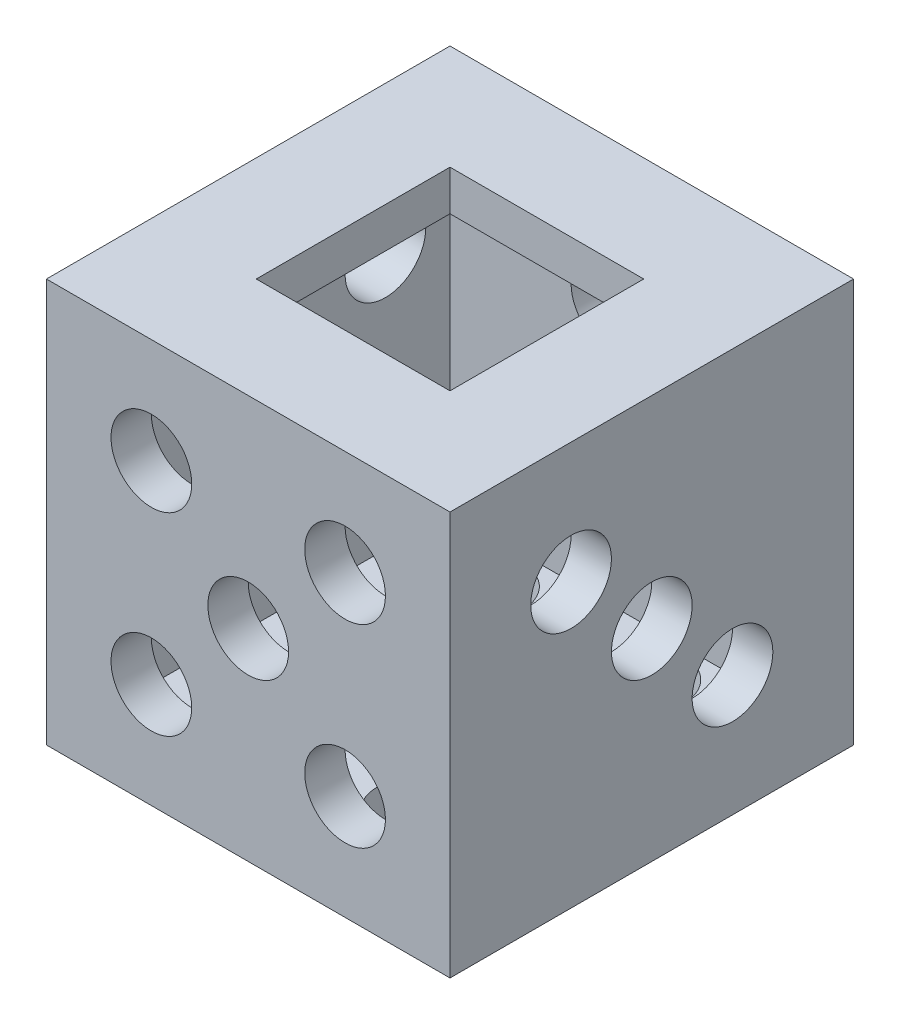
ISO-10303-21;
HEADER;
FILE_DESCRIPTION(('STEP AP214'),'2;1');
FILE_NAME('part.step','',(''),(''),'','','');
FILE_SCHEMA(('AUTOMOTIVE_DESIGN { 1 0 10303 214 1 1 1 1 }'));
ENDSEC;
DATA;
#1=APPLICATION_CONTEXT('core data for automotive mechanical design processes');
#2=APPLICATION_PROTOCOL_DEFINITION('international standard','automotive_design',2000,#1);
#3=PRODUCT_CONTEXT('',#1,'mechanical');
#4=PRODUCT('Part','Part','',(#3));
#5=PRODUCT_RELATED_PRODUCT_CATEGORY('part','',(#4));
#6=PRODUCT_DEFINITION_FORMATION('','',#4);
#7=PRODUCT_DEFINITION_CONTEXT('part definition',#1,'design');
#8=PRODUCT_DEFINITION('design','',#6,#7);
#9=PRODUCT_DEFINITION_SHAPE('','',#8);
#10=(LENGTH_UNIT() NAMED_UNIT(*) SI_UNIT(.MILLI.,.METRE.));
#11=(NAMED_UNIT(*) PLANE_ANGLE_UNIT() SI_UNIT($,.RADIAN.));
#12=(NAMED_UNIT(*) SI_UNIT($,.STERADIAN.) SOLID_ANGLE_UNIT());
#13=UNCERTAINTY_MEASURE_WITH_UNIT(LENGTH_MEASURE(1.E-05),#10,'distance_accuracy_value','');
#14=(GEOMETRIC_REPRESENTATION_CONTEXT(3) GLOBAL_UNCERTAINTY_ASSIGNED_CONTEXT((#13)) GLOBAL_UNIT_ASSIGNED_CONTEXT((#10,
#11,#12)) REPRESENTATION_CONTEXT('',''));
#15=CARTESIAN_POINT('',(0.,0.,0.));
#16=DIRECTION('',(0.,0.,1.));
#17=DIRECTION('',(1.,0.,0.));
#18=AXIS2_PLACEMENT_3D('',#15,#16,#17);
#19=CARTESIAN_POINT('',(10.,25.,-12.5));
#20=DIRECTION('',(-1.,0.,0.));
#21=DIRECTION('',(0.,0.,1.));
#22=AXIS2_PLACEMENT_3D('',#19,#20,#21);
#23=PLANE('',#22);
#24=CARTESIAN_POINT('',(10.,7.50000000000005,-5.));
#25=DIRECTION('',(-1.,0.,0.));
#26=DIRECTION('',(0.,0.,1.));
#27=AXIS2_PLACEMENT_3D('',#24,#25,#26);
#28=CIRCLE('',#27,2.5);
#29=CARTESIAN_POINT('',(10.,7.50000000000005,-2.5));
#30=VERTEX_POINT('',#29);
#31=EDGE_CURVE('E706',#30,#30,#28,.T.);
#32=ORIENTED_EDGE('',*,*,#31,.F.);
#33=EDGE_LOOP('',(#32));
#34=FACE_BOUND('',#33,.T.);
#35=CARTESIAN_POINT('',(10.,12.5,0.));
#36=DIRECTION('',(-1.,0.,0.));
#37=DIRECTION('',(0.,0.,1.));
#38=AXIS2_PLACEMENT_3D('',#35,#36,#37);
#39=CIRCLE('',#38,2.5);
#40=CARTESIAN_POINT('',(10.,12.5,2.5));
#41=VERTEX_POINT('',#40);
#42=EDGE_CURVE('E702',#41,#41,#39,.T.);
#43=ORIENTED_EDGE('',*,*,#42,.F.);
#44=EDGE_LOOP('',(#43));
#45=FACE_BOUND('',#44,.T.);
#46=CARTESIAN_POINT('',(10.,17.5,5.));
#47=DIRECTION('',(-1.,0.,0.));
#48=DIRECTION('',(0.,0.,1.));
#49=AXIS2_PLACEMENT_3D('',#46,#47,#48);
#50=CIRCLE('',#49,2.5);
#51=CARTESIAN_POINT('',(10.,17.5,7.5));
#52=VERTEX_POINT('',#51);
#53=EDGE_CURVE('E714',#52,#52,#50,.T.);
#54=ORIENTED_EDGE('',*,*,#53,.F.);
#55=EDGE_LOOP('',(#54));
#56=FACE_BOUND('',#55,.T.);
#57=DIRECTION('',(0.,0.,-1.));
#58=VECTOR('',#57,1.);
#59=CARTESIAN_POINT('',(10.,2.5,-12.5));
#60=LINE('',#59,#58);
#61=CARTESIAN_POINT('',(10.,2.5,10.));
#62=VERTEX_POINT('',#61);
#63=CARTESIAN_POINT('',(10.,2.5,-10.));
#64=VERTEX_POINT('',#63);
#65=EDGE_CURVE('E206',#62,#64,#60,.T.);
#66=ORIENTED_EDGE('',*,*,#65,.F.);
#67=DIRECTION('',(0.,-1.,0.));
#68=VECTOR('',#67,1.);
#69=CARTESIAN_POINT('',(10.,25.,10.));
#70=LINE('',#69,#68);
#71=CARTESIAN_POINT('',(10.,22.5,10.));
#72=VERTEX_POINT('',#71);
#73=EDGE_CURVE('E242',#72,#62,#70,.T.);
#74=ORIENTED_EDGE('',*,*,#73,.F.);
#75=DIRECTION('',(0.,0.,-1.));
#76=VECTOR('',#75,1.);
#77=CARTESIAN_POINT('',(10.,22.5,-12.5));
#78=LINE('',#77,#76);
#79=CARTESIAN_POINT('',(10.,22.5,-10.));
#80=VERTEX_POINT('',#79);
#81=EDGE_CURVE('E217',#72,#80,#78,.T.);
#82=ORIENTED_EDGE('',*,*,#81,.T.);
#83=DIRECTION('',(0.,-1.,0.));
#84=VECTOR('',#83,1.);
#85=CARTESIAN_POINT('',(10.,25.,-10.));
#86=LINE('',#85,#84);
#87=EDGE_CURVE('E235',#80,#64,#86,.T.);
#88=ORIENTED_EDGE('',*,*,#87,.T.);
#89=EDGE_LOOP('',(#66,#74,#82,#88));
#90=FACE_BOUND('',#89,.T.);
#91=ADVANCED_FACE('F39',(#34,#45,#56,#90),#23,.T.);
#92=CARTESIAN_POINT('',(-12.5,25.,-10.));
#93=DIRECTION('',(0.,0.,1.));
#94=DIRECTION('',(1.,0.,0.));
#95=AXIS2_PLACEMENT_3D('',#92,#93,#94);
#96=PLANE('',#95);
#97=CARTESIAN_POINT('',(0.,18.5,-10.));
#98=DIRECTION('',(0.,0.,1.));
#99=DIRECTION('',(1.,0.,0.));
#100=AXIS2_PLACEMENT_3D('',#97,#98,#99);
#101=CIRCLE('',#100,2.5);
#102=CARTESIAN_POINT('',(2.5,18.5,-10.));
#103=VERTEX_POINT('',#102);
#104=EDGE_CURVE('E605',#103,#103,#101,.T.);
#105=ORIENTED_EDGE('',*,*,#104,.F.);
#106=EDGE_LOOP('',(#105));
#107=FACE_BOUND('',#106,.T.);
#108=CARTESIAN_POINT('',(0.,6.5,-10.));
#109=DIRECTION('',(0.,0.,1.));
#110=DIRECTION('',(1.,0.,0.));
#111=AXIS2_PLACEMENT_3D('',#108,#109,#110);
#112=CIRCLE('',#111,2.5);
#113=CARTESIAN_POINT('',(2.5,6.5,-10.));
#114=VERTEX_POINT('',#113);
#115=EDGE_CURVE('E610',#114,#114,#112,.T.);
#116=ORIENTED_EDGE('',*,*,#115,.F.);
#117=EDGE_LOOP('',(#116));
#118=FACE_BOUND('',#117,.T.);
#119=DIRECTION('',(-1.,0.,0.));
#120=VECTOR('',#119,1.);
#121=CARTESIAN_POINT('',(-12.5,2.5,-10.));
#122=LINE('',#121,#120);
#123=CARTESIAN_POINT('',(-10.,2.5,-10.));
#124=VERTEX_POINT('',#123);
#125=EDGE_CURVE('E239',#64,#124,#122,.T.);
#126=ORIENTED_EDGE('',*,*,#125,.F.);
#127=ORIENTED_EDGE('',*,*,#87,.F.);
#128=DIRECTION('',(-1.,0.,0.));
#129=VECTOR('',#128,1.);
#130=CARTESIAN_POINT('',(-12.5,22.5,-10.));
#131=LINE('',#130,#129);
#132=CARTESIAN_POINT('',(-10.,22.5,-10.));
#133=VERTEX_POINT('',#132);
#134=EDGE_CURVE('E214',#80,#133,#131,.T.);
#135=ORIENTED_EDGE('',*,*,#134,.T.);
#136=DIRECTION('',(0.,-1.,0.));
#137=VECTOR('',#136,1.);
#138=CARTESIAN_POINT('',(-10.,25.,-10.));
#139=LINE('',#138,#137);
#140=EDGE_CURVE('E228',#133,#124,#139,.T.);
#141=ORIENTED_EDGE('',*,*,#140,.T.);
#142=EDGE_LOOP('',(#126,#127,#135,#141));
#143=FACE_BOUND('',#142,.T.);
#144=ADVANCED_FACE('F272',(#107,#118,#143),#96,.T.);
#145=CARTESIAN_POINT('',(-10.,25.,-12.5));
#146=DIRECTION('',(1.,0.,0.));
#147=DIRECTION('',(0.,0.,-1.));
#148=AXIS2_PLACEMENT_3D('',#145,#146,#147);
#149=PLANE('',#148);
#150=CARTESIAN_POINT('',(-10.,6.5,-6.));
#151=DIRECTION('',(1.,0.,0.));
#152=DIRECTION('',(0.,0.,-1.));
#153=AXIS2_PLACEMENT_3D('',#150,#151,#152);
#154=CIRCLE('',#153,2.5);
#155=CARTESIAN_POINT('',(-10.,6.5,-8.5));
#156=VERTEX_POINT('',#155);
#157=EDGE_CURVE('E674',#156,#156,#154,.T.);
#158=ORIENTED_EDGE('',*,*,#157,.F.);
#159=EDGE_LOOP('',(#158));
#160=FACE_BOUND('',#159,.T.);
#161=CARTESIAN_POINT('',(-10.,6.5,6.));
#162=DIRECTION('',(1.,0.,0.));
#163=DIRECTION('',(0.,0.,-1.));
#164=AXIS2_PLACEMENT_3D('',#161,#162,#163);
#165=CIRCLE('',#164,2.5);
#166=CARTESIAN_POINT('',(-10.,6.5,3.5));
#167=VERTEX_POINT('',#166);
#168=EDGE_CURVE('E667',#167,#167,#165,.T.);
#169=ORIENTED_EDGE('',*,*,#168,.F.);
#170=EDGE_LOOP('',(#169));
#171=FACE_BOUND('',#170,.T.);
#172=CARTESIAN_POINT('',(-10.,18.5,6.));
#173=DIRECTION('',(1.,0.,0.));
#174=DIRECTION('',(0.,0.,-1.));
#175=AXIS2_PLACEMENT_3D('',#172,#173,#174);
#176=CIRCLE('',#175,2.5);
#177=CARTESIAN_POINT('',(-10.,18.5,3.5));
#178=VERTEX_POINT('',#177);
#179=EDGE_CURVE('E682',#178,#178,#176,.T.);
#180=ORIENTED_EDGE('',*,*,#179,.F.);
#181=EDGE_LOOP('',(#180));
#182=FACE_BOUND('',#181,.T.);
#183=CARTESIAN_POINT('',(-10.,18.5,-6.));
#184=DIRECTION('',(1.,0.,0.));
#185=DIRECTION('',(0.,0.,-1.));
#186=AXIS2_PLACEMENT_3D('',#183,#184,#185);
#187=CIRCLE('',#186,2.5);
#188=CARTESIAN_POINT('',(-10.,18.5,-8.5));
#189=VERTEX_POINT('',#188);
#190=EDGE_CURVE('E690',#189,#189,#187,.T.);
#191=ORIENTED_EDGE('',*,*,#190,.F.);
#192=EDGE_LOOP('',(#191));
#193=FACE_BOUND('',#192,.T.);
#194=DIRECTION('',(0.,0.,1.));
#195=VECTOR('',#194,1.);
#196=CARTESIAN_POINT('',(-10.,2.5,-12.5));
#197=LINE('',#196,#195);
#198=CARTESIAN_POINT('',(-10.,2.5,10.));
#199=VERTEX_POINT('',#198);
#200=EDGE_CURVE('E232',#124,#199,#197,.T.);
#201=ORIENTED_EDGE('',*,*,#200,.F.);
#202=ORIENTED_EDGE('',*,*,#140,.F.);
#203=DIRECTION('',(0.,0.,1.));
#204=VECTOR('',#203,1.);
#205=CARTESIAN_POINT('',(-10.,22.5,-12.5));
#206=LINE('',#205,#204);
#207=CARTESIAN_POINT('',(-10.,22.5,10.));
#208=VERTEX_POINT('',#207);
#209=EDGE_CURVE('E211',#133,#208,#206,.T.);
#210=ORIENTED_EDGE('',*,*,#209,.T.);
#211=DIRECTION('',(0.,-1.,0.));
#212=VECTOR('',#211,1.);
#213=CARTESIAN_POINT('',(-10.,25.,10.));
#214=LINE('',#213,#212);
#215=EDGE_CURVE('E221',#208,#199,#214,.T.);
#216=ORIENTED_EDGE('',*,*,#215,.T.);
#217=EDGE_LOOP('',(#201,#202,#210,#216));
#218=FACE_BOUND('',#217,.T.);
#219=ADVANCED_FACE('F278',(#160,#171,#182,#193,#218),#149,.T.);
#220=CARTESIAN_POINT('',(-12.5,25.,10.));
#221=DIRECTION('',(0.,0.,-1.));
#222=DIRECTION('',(-1.,0.,0.));
#223=AXIS2_PLACEMENT_3D('',#220,#221,#222);
#224=PLANE('',#223);
#225=CARTESIAN_POINT('',(6.,6.5,10.));
#226=DIRECTION('',(0.,0.,-1.));
#227=DIRECTION('',(-1.,0.,0.));
#228=AXIS2_PLACEMENT_3D('',#225,#226,#227);
#229=CIRCLE('',#228,2.5);
#230=CARTESIAN_POINT('',(3.5,6.5,10.));
#231=VERTEX_POINT('',#230);
#232=EDGE_CURVE('E658',#231,#231,#229,.T.);
#233=ORIENTED_EDGE('',*,*,#232,.F.);
#234=EDGE_LOOP('',(#233));
#235=FACE_BOUND('',#234,.T.);
#236=CARTESIAN_POINT('',(-6.,6.5,10.));
#237=DIRECTION('',(0.,0.,-1.));
#238=DIRECTION('',(-1.,0.,0.));
#239=AXIS2_PLACEMENT_3D('',#236,#237,#238);
#240=CIRCLE('',#239,2.5);
#241=CARTESIAN_POINT('',(-8.5,6.5,10.));
#242=VERTEX_POINT('',#241);
#243=EDGE_CURVE('E654',#242,#242,#240,.T.);
#244=ORIENTED_EDGE('',*,*,#243,.F.);
#245=EDGE_LOOP('',(#244));
#246=FACE_BOUND('',#245,.T.);
#247=CARTESIAN_POINT('',(-6.,18.5,10.));
#248=DIRECTION('',(0.,0.,-1.));
#249=DIRECTION('',(-1.,0.,0.));
#250=AXIS2_PLACEMENT_3D('',#247,#248,#249);
#251=CIRCLE('',#250,2.5);
#252=CARTESIAN_POINT('',(-8.5,18.5,10.));
#253=VERTEX_POINT('',#252);
#254=EDGE_CURVE('E650',#253,#253,#251,.T.);
#255=ORIENTED_EDGE('',*,*,#254,.F.);
#256=EDGE_LOOP('',(#255));
#257=FACE_BOUND('',#256,.T.);
#258=CARTESIAN_POINT('',(6.,18.5,10.));
#259=DIRECTION('',(0.,0.,-1.));
#260=DIRECTION('',(-1.,0.,0.));
#261=AXIS2_PLACEMENT_3D('',#258,#259,#260);
#262=CIRCLE('',#261,2.5);
#263=CARTESIAN_POINT('',(3.5,18.5,10.));
#264=VERTEX_POINT('',#263);
#265=EDGE_CURVE('E646',#264,#264,#262,.T.);
#266=ORIENTED_EDGE('',*,*,#265,.F.);
#267=EDGE_LOOP('',(#266));
#268=FACE_BOUND('',#267,.T.);
#269=CARTESIAN_POINT('',(0.,12.5,10.));
#270=DIRECTION('',(0.,0.,-1.));
#271=DIRECTION('',(-1.,0.,0.));
#272=AXIS2_PLACEMENT_3D('',#269,#270,#271);
#273=CIRCLE('',#272,2.5);
#274=CARTESIAN_POINT('',(-2.5,12.5,10.));
#275=VERTEX_POINT('',#274);
#276=EDGE_CURVE('E642',#275,#275,#273,.T.);
#277=ORIENTED_EDGE('',*,*,#276,.F.);
#278=EDGE_LOOP('',(#277));
#279=FACE_BOUND('',#278,.T.);
#280=DIRECTION('',(1.,0.,0.));
#281=VECTOR('',#280,1.);
#282=CARTESIAN_POINT('',(-12.5,2.5,10.));
#283=LINE('',#282,#281);
#284=EDGE_CURVE('E225',#199,#62,#283,.T.);
#285=ORIENTED_EDGE('',*,*,#284,.F.);
#286=ORIENTED_EDGE('',*,*,#215,.F.);
#287=DIRECTION('',(1.,0.,0.));
#288=VECTOR('',#287,1.);
#289=CARTESIAN_POINT('',(-12.5,22.5,10.));
#290=LINE('',#289,#288);
#291=EDGE_CURVE('E207',#208,#72,#290,.T.);
#292=ORIENTED_EDGE('',*,*,#291,.T.);
#293=ORIENTED_EDGE('',*,*,#73,.T.);
#294=EDGE_LOOP('',(#285,#286,#292,#293));
#295=FACE_BOUND('',#294,.T.);
#296=ADVANCED_FACE('F289',(#235,#246,#257,#268,#279,#295),#224,.T.);
#297=CARTESIAN_POINT('',(0.,22.5,0.));
#298=DIRECTION('',(0.,1.,0.));
#299=DIRECTION('',(0.,0.,1.));
#300=AXIS2_PLACEMENT_3D('',#297,#298,#299);
#301=PLANE('',#300);
#302=DIRECTION('',(1.,0.,0.));
#303=VECTOR('',#302,1.);
#304=CARTESIAN_POINT('',(0.,22.5,6.));
#305=LINE('',#304,#303);
#306=CARTESIAN_POINT('',(-6.,22.5,6.));
#307=VERTEX_POINT('',#306);
#308=CARTESIAN_POINT('',(6.,22.5,6.));
#309=VERTEX_POINT('',#308);
#310=EDGE_CURVE('E48',#307,#309,#305,.T.);
#311=ORIENTED_EDGE('',*,*,#310,.T.);
#312=DIRECTION('',(0.,0.,-1.));
#313=VECTOR('',#312,1.);
#314=CARTESIAN_POINT('',(6.,22.5,0.));
#315=LINE('',#314,#313);
#316=CARTESIAN_POINT('',(6.,22.5,-6.));
#317=VERTEX_POINT('',#316);
#318=EDGE_CURVE('E11',#309,#317,#315,.T.);
#319=ORIENTED_EDGE('',*,*,#318,.T.);
#320=DIRECTION('',(-1.,0.,0.));
#321=VECTOR('',#320,1.);
#322=CARTESIAN_POINT('',(0.,22.5,-6.));
#323=LINE('',#322,#321);
#324=CARTESIAN_POINT('',(-6.,22.5,-6.));
#325=VERTEX_POINT('',#324);
#326=EDGE_CURVE('E210',#317,#325,#323,.T.);
#327=ORIENTED_EDGE('',*,*,#326,.T.);
#328=DIRECTION('',(0.,0.,1.));
#329=VECTOR('',#328,1.);
#330=CARTESIAN_POINT('',(-6.,22.5,0.));
#331=LINE('',#330,#329);
#332=EDGE_CURVE('E135',#325,#307,#331,.T.);
#333=ORIENTED_EDGE('',*,*,#332,.T.);
#334=EDGE_LOOP('',(#311,#319,#327,#333));
#335=FACE_BOUND('',#334,.T.);
#336=ORIENTED_EDGE('',*,*,#81,.F.);
#337=ORIENTED_EDGE('',*,*,#291,.F.);
#338=ORIENTED_EDGE('',*,*,#209,.F.);
#339=ORIENTED_EDGE('',*,*,#134,.F.);
#340=EDGE_LOOP('',(#336,#337,#338,#339));
#341=FACE_BOUND('',#340,.T.);
#342=ADVANCED_FACE('F255',(#335,#341),#301,.F.);
#343=CARTESIAN_POINT('',(0.,2.5,0.));
#344=DIRECTION('',(0.,1.,0.));
#345=DIRECTION('',(0.,0.,1.));
#346=AXIS2_PLACEMENT_3D('',#343,#344,#345);
#347=PLANE('',#346);
#348=CARTESIAN_POINT('',(-5.,2.5,0.));
#349=DIRECTION('',(0.,1.,0.));
#350=DIRECTION('',(0.,0.,1.));
#351=AXIS2_PLACEMENT_3D('',#348,#349,#350);
#352=CIRCLE('',#351,2.5);
#353=CARTESIAN_POINT('',(-5.,2.5,2.5));
#354=VERTEX_POINT('',#353);
#355=EDGE_CURVE('E762',#354,#354,#352,.T.);
#356=ORIENTED_EDGE('',*,*,#355,.F.);
#357=EDGE_LOOP('',(#356));
#358=FACE_BOUND('',#357,.T.);
#359=CARTESIAN_POINT('',(-5.,2.5,-7.));
#360=DIRECTION('',(0.,1.,0.));
#361=DIRECTION('',(0.,0.,1.));
#362=AXIS2_PLACEMENT_3D('',#359,#360,#361);
#363=CIRCLE('',#362,2.5);
#364=CARTESIAN_POINT('',(-5.,2.5,-4.5));
#365=VERTEX_POINT('',#364);
#366=EDGE_CURVE('E758',#365,#365,#363,.T.);
#367=ORIENTED_EDGE('',*,*,#366,.F.);
#368=EDGE_LOOP('',(#367));
#369=FACE_BOUND('',#368,.T.);
#370=CARTESIAN_POINT('',(5.,2.5,7.));
#371=DIRECTION('',(0.,1.,0.));
#372=DIRECTION('',(0.,0.,1.));
#373=AXIS2_PLACEMENT_3D('',#370,#371,#372);
#374=CIRCLE('',#373,2.5);
#375=CARTESIAN_POINT('',(5.,2.5,9.5));
#376=VERTEX_POINT('',#375);
#377=EDGE_CURVE('E754',#376,#376,#374,.T.);
#378=ORIENTED_EDGE('',*,*,#377,.F.);
#379=EDGE_LOOP('',(#378));
#380=FACE_BOUND('',#379,.T.);
#381=CARTESIAN_POINT('',(5.,2.5,0.));
#382=DIRECTION('',(0.,1.,0.));
#383=DIRECTION('',(0.,0.,1.));
#384=AXIS2_PLACEMENT_3D('',#381,#382,#383);
#385=CIRCLE('',#384,2.5);
#386=CARTESIAN_POINT('',(5.,2.5,2.5));
#387=VERTEX_POINT('',#386);
#388=EDGE_CURVE('E750',#387,#387,#385,.T.);
#389=ORIENTED_EDGE('',*,*,#388,.F.);
#390=EDGE_LOOP('',(#389));
#391=FACE_BOUND('',#390,.T.);
#392=CARTESIAN_POINT('',(5.,2.5,-7.));
#393=DIRECTION('',(0.,1.,0.));
#394=DIRECTION('',(0.,0.,1.));
#395=AXIS2_PLACEMENT_3D('',#392,#393,#394);
#396=CIRCLE('',#395,2.5);
#397=CARTESIAN_POINT('',(5.,2.5,-4.5));
#398=VERTEX_POINT('',#397);
#399=EDGE_CURVE('E746',#398,#398,#396,.T.);
#400=ORIENTED_EDGE('',*,*,#399,.F.);
#401=EDGE_LOOP('',(#400));
#402=FACE_BOUND('',#401,.T.);
#403=CARTESIAN_POINT('',(-5.,2.5,7.));
#404=DIRECTION('',(0.,1.,0.));
#405=DIRECTION('',(0.,0.,1.));
#406=AXIS2_PLACEMENT_3D('',#403,#404,#405);
#407=CIRCLE('',#406,2.5);
#408=CARTESIAN_POINT('',(-5.,2.5,9.5));
#409=VERTEX_POINT('',#408);
#410=EDGE_CURVE('E742',#409,#409,#407,.T.);
#411=ORIENTED_EDGE('',*,*,#410,.F.);
#412=EDGE_LOOP('',(#411));
#413=FACE_BOUND('',#412,.T.);
#414=ORIENTED_EDGE('',*,*,#65,.T.);
#415=ORIENTED_EDGE('',*,*,#125,.T.);
#416=ORIENTED_EDGE('',*,*,#200,.T.);
#417=ORIENTED_EDGE('',*,*,#284,.T.);
#418=EDGE_LOOP('',(#414,#415,#416,#417));
#419=FACE_BOUND('',#418,.T.);
#420=ADVANCED_FACE('F41',(#358,#369,#380,#391,#402,#413,#419),#347,.T.);
#421=CARTESIAN_POINT('',(6.,10.,-6.));
#422=DIRECTION('',(1.,0.,0.));
#423=DIRECTION('',(0.,0.,-1.));
#424=AXIS2_PLACEMENT_3D('',#421,#422,#423);
#425=PLANE('',#424);
#426=DIRECTION('',(0.,1.,0.));
#427=VECTOR('',#426,1.);
#428=CARTESIAN_POINT('',(6.,10.,6.));
#429=LINE('',#428,#427);
#430=CARTESIAN_POINT('',(6.,25.,6.));
#431=VERTEX_POINT('',#430);
#432=EDGE_CURVE('E157',#309,#431,#429,.T.);
#433=ORIENTED_EDGE('',*,*,#432,.T.);
#434=DIRECTION('',(0.,0.,-1.));
#435=VECTOR('',#434,1.);
#436=CARTESIAN_POINT('',(6.,25.,-6.));
#437=LINE('',#436,#435);
#438=CARTESIAN_POINT('',(6.,25.,-6.));
#439=VERTEX_POINT('',#438);
#440=EDGE_CURVE('E55',#431,#439,#437,.T.);
#441=ORIENTED_EDGE('',*,*,#440,.T.);
#442=DIRECTION('',(0.,1.,0.));
#443=VECTOR('',#442,1.);
#444=CARTESIAN_POINT('',(6.,10.,-6.));
#445=LINE('',#444,#443);
#446=EDGE_CURVE('E139',#317,#439,#445,.T.);
#447=ORIENTED_EDGE('',*,*,#446,.F.);
#448=ORIENTED_EDGE('',*,*,#318,.F.);
#449=EDGE_LOOP('',(#433,#441,#447,#448));
#450=FACE_BOUND('',#449,.T.);
#451=ADVANCED_FACE('F260',(#450),#425,.F.);
#452=CARTESIAN_POINT('',(-6.,10.,6.));
#453=DIRECTION('',(0.,0.,1.));
#454=DIRECTION('',(1.,0.,0.));
#455=AXIS2_PLACEMENT_3D('',#452,#453,#454);
#456=PLANE('',#455);
#457=DIRECTION('',(0.,1.,0.));
#458=VECTOR('',#457,1.);
#459=CARTESIAN_POINT('',(-6.,10.,6.));
#460=LINE('',#459,#458);
#461=CARTESIAN_POINT('',(-6.,25.,6.));
#462=VERTEX_POINT('',#461);
#463=EDGE_CURVE('E138',#307,#462,#460,.T.);
#464=ORIENTED_EDGE('',*,*,#463,.T.);
#465=DIRECTION('',(1.,0.,0.));
#466=VECTOR('',#465,1.);
#467=CARTESIAN_POINT('',(-6.,25.,6.));
#468=LINE('',#467,#466);
#469=EDGE_CURVE('E150',#462,#431,#468,.T.);
#470=ORIENTED_EDGE('',*,*,#469,.T.);
#471=ORIENTED_EDGE('',*,*,#432,.F.);
#472=ORIENTED_EDGE('',*,*,#310,.F.);
#473=EDGE_LOOP('',(#464,#470,#471,#472));
#474=FACE_BOUND('',#473,.T.);
#475=ADVANCED_FACE('F259',(#474),#456,.F.);
#476=CARTESIAN_POINT('',(-6.,10.,-6.));
#477=DIRECTION('',(-1.,0.,0.));
#478=DIRECTION('',(0.,0.,1.));
#479=AXIS2_PLACEMENT_3D('',#476,#477,#478);
#480=PLANE('',#479);
#481=DIRECTION('',(0.,1.,0.));
#482=VECTOR('',#481,1.);
#483=CARTESIAN_POINT('',(-6.,10.,-6.));
#484=LINE('',#483,#482);
#485=CARTESIAN_POINT('',(-6.,25.,-6.));
#486=VERTEX_POINT('',#485);
#487=EDGE_CURVE('E63',#325,#486,#484,.T.);
#488=ORIENTED_EDGE('',*,*,#487,.T.);
#489=DIRECTION('',(0.,0.,1.));
#490=VECTOR('',#489,1.);
#491=CARTESIAN_POINT('',(-6.,25.,-6.));
#492=LINE('',#491,#490);
#493=EDGE_CURVE('E132',#486,#462,#492,.T.);
#494=ORIENTED_EDGE('',*,*,#493,.T.);
#495=ORIENTED_EDGE('',*,*,#463,.F.);
#496=ORIENTED_EDGE('',*,*,#332,.F.);
#497=EDGE_LOOP('',(#488,#494,#495,#496));
#498=FACE_BOUND('',#497,.T.);
#499=ADVANCED_FACE('F129',(#498),#480,.F.);
#500=CARTESIAN_POINT('',(-6.,10.,-6.));
#501=DIRECTION('',(0.,0.,-1.));
#502=DIRECTION('',(-1.,0.,0.));
#503=AXIS2_PLACEMENT_3D('',#500,#501,#502);
#504=PLANE('',#503);
#505=ORIENTED_EDGE('',*,*,#446,.T.);
#506=DIRECTION('',(-1.,0.,0.));
#507=VECTOR('',#506,1.);
#508=CARTESIAN_POINT('',(-6.,25.,-6.));
#509=LINE('',#508,#507);
#510=EDGE_CURVE('E142',#439,#486,#509,.T.);
#511=ORIENTED_EDGE('',*,*,#510,.T.);
#512=ORIENTED_EDGE('',*,*,#487,.F.);
#513=ORIENTED_EDGE('',*,*,#326,.F.);
#514=EDGE_LOOP('',(#505,#511,#512,#513));
#515=FACE_BOUND('',#514,.T.);
#516=ADVANCED_FACE('F143',(#515),#504,.F.);
#517=CARTESIAN_POINT('',(12.5,25.,-12.5));
#518=DIRECTION('',(-1.,0.,0.));
#519=DIRECTION('',(0.,0.,1.));
#520=AXIS2_PLACEMENT_3D('',#517,#518,#519);
#521=PLANE('',#520);
#522=CARTESIAN_POINT('',(12.5,7.50000000000005,-5.));
#523=DIRECTION('',(1.,0.,0.));
#524=DIRECTION('',(0.,0.,-1.));
#525=AXIS2_PLACEMENT_3D('',#522,#523,#524);
#526=CIRCLE('',#525,2.5);
#527=CARTESIAN_POINT('',(12.5,7.50000000000005,-7.5));
#528=VERTEX_POINT('',#527);
#529=EDGE_CURVE('E694',#528,#528,#526,.T.);
#530=ORIENTED_EDGE('',*,*,#529,.F.);
#531=EDGE_LOOP('',(#530));
#532=FACE_BOUND('',#531,.T.);
#533=CARTESIAN_POINT('',(12.5,12.5,0.));
#534=DIRECTION('',(1.,0.,0.));
#535=DIRECTION('',(0.,0.,-1.));
#536=AXIS2_PLACEMENT_3D('',#533,#534,#535);
#537=CIRCLE('',#536,2.5);
#538=CARTESIAN_POINT('',(12.5,12.5,-2.5));
#539=VERTEX_POINT('',#538);
#540=EDGE_CURVE('E698',#539,#539,#537,.T.);
#541=ORIENTED_EDGE('',*,*,#540,.F.);
#542=EDGE_LOOP('',(#541));
#543=FACE_BOUND('',#542,.T.);
#544=CARTESIAN_POINT('',(12.5,17.5,5.));
#545=DIRECTION('',(1.,0.,0.));
#546=DIRECTION('',(0.,0.,-1.));
#547=AXIS2_PLACEMENT_3D('',#544,#545,#546);
#548=CIRCLE('',#547,2.5);
#549=CARTESIAN_POINT('',(12.5,17.5,2.5));
#550=VERTEX_POINT('',#549);
#551=EDGE_CURVE('E710',#550,#550,#548,.T.);
#552=ORIENTED_EDGE('',*,*,#551,.F.);
#553=EDGE_LOOP('',(#552));
#554=FACE_BOUND('',#553,.T.);
#555=DIRECTION('',(0.,0.,-1.));
#556=VECTOR('',#555,1.);
#557=CARTESIAN_POINT('',(12.5,0.,-12.5));
#558=LINE('',#557,#556);
#559=CARTESIAN_POINT('',(12.5,0.,12.5));
#560=VERTEX_POINT('',#559);
#561=CARTESIAN_POINT('',(12.5,0.,-12.5));
#562=VERTEX_POINT('',#561);
#563=EDGE_CURVE('E160',#560,#562,#558,.T.);
#564=ORIENTED_EDGE('',*,*,#563,.T.);
#565=DIRECTION('',(0.,-1.,0.));
#566=VECTOR('',#565,1.);
#567=CARTESIAN_POINT('',(12.5,25.,-12.5));
#568=LINE('',#567,#566);
#569=CARTESIAN_POINT('',(12.5,25.,-12.5));
#570=VERTEX_POINT('',#569);
#571=EDGE_CURVE('E202',#570,#562,#568,.T.);
#572=ORIENTED_EDGE('',*,*,#571,.F.);
#573=DIRECTION('',(0.,0.,-1.));
#574=VECTOR('',#573,1.);
#575=CARTESIAN_POINT('',(12.5,25.,-12.5));
#576=LINE('',#575,#574);
#577=CARTESIAN_POINT('',(12.5,25.,12.5));
#578=VERTEX_POINT('',#577);
#579=EDGE_CURVE('E165',#578,#570,#576,.T.);
#580=ORIENTED_EDGE('',*,*,#579,.F.);
#581=DIRECTION('',(0.,-1.,0.));
#582=VECTOR('',#581,1.);
#583=CARTESIAN_POINT('',(12.5,25.,12.5));
#584=LINE('',#583,#582);
#585=EDGE_CURVE('E179',#578,#560,#584,.T.);
#586=ORIENTED_EDGE('',*,*,#585,.T.);
#587=EDGE_LOOP('',(#564,#572,#580,#586));
#588=FACE_BOUND('',#587,.T.);
#589=ADVANCED_FACE('F284',(#532,#543,#554,#588),#521,.F.);
#590=CARTESIAN_POINT('',(-12.5,25.,-12.5));
#591=DIRECTION('',(0.,0.,1.));
#592=DIRECTION('',(1.,0.,0.));
#593=AXIS2_PLACEMENT_3D('',#590,#591,#592);
#594=PLANE('',#593);
#595=CARTESIAN_POINT('',(0.,18.5,-12.5));
#596=DIRECTION('',(0.,0.,-1.));
#597=DIRECTION('',(-1.,0.,0.));
#598=AXIS2_PLACEMENT_3D('',#595,#596,#597);
#599=CIRCLE('',#598,2.5);
#600=CARTESIAN_POINT('',(-2.5,18.5,-12.5));
#601=VERTEX_POINT('',#600);
#602=EDGE_CURVE('E608',#601,#601,#599,.T.);
#603=ORIENTED_EDGE('',*,*,#602,.F.);
#604=EDGE_LOOP('',(#603));
#605=FACE_BOUND('',#604,.T.);
#606=CARTESIAN_POINT('',(0.,6.5,-12.5));
#607=DIRECTION('',(0.,0.,-1.));
#608=DIRECTION('',(-1.,0.,0.));
#609=AXIS2_PLACEMENT_3D('',#606,#607,#608);
#610=CIRCLE('',#609,2.5);
#611=CARTESIAN_POINT('',(-2.5,6.5,-12.5));
#612=VERTEX_POINT('',#611);
#613=EDGE_CURVE('E611',#612,#612,#610,.T.);
#614=ORIENTED_EDGE('',*,*,#613,.F.);
#615=EDGE_LOOP('',(#614));
#616=FACE_BOUND('',#615,.T.);
#617=DIRECTION('',(-1.,0.,0.));
#618=VECTOR('',#617,1.);
#619=CARTESIAN_POINT('',(-12.5,0.,-12.5));
#620=LINE('',#619,#618);
#621=CARTESIAN_POINT('',(-12.5,0.,-12.5));
#622=VERTEX_POINT('',#621);
#623=EDGE_CURVE('E183',#562,#622,#620,.T.);
#624=ORIENTED_EDGE('',*,*,#623,.T.);
#625=DIRECTION('',(0.,-1.,0.));
#626=VECTOR('',#625,1.);
#627=CARTESIAN_POINT('',(-12.5,25.,-12.5));
#628=LINE('',#627,#626);
#629=CARTESIAN_POINT('',(-12.5,25.,-12.5));
#630=VERTEX_POINT('',#629);
#631=EDGE_CURVE('E198',#630,#622,#628,.T.);
#632=ORIENTED_EDGE('',*,*,#631,.F.);
#633=DIRECTION('',(-1.,0.,0.));
#634=VECTOR('',#633,1.);
#635=CARTESIAN_POINT('',(-12.5,25.,-12.5));
#636=LINE('',#635,#634);
#637=EDGE_CURVE('E169',#570,#630,#636,.T.);
#638=ORIENTED_EDGE('',*,*,#637,.F.);
#639=ORIENTED_EDGE('',*,*,#571,.T.);
#640=EDGE_LOOP('',(#624,#632,#638,#639));
#641=FACE_BOUND('',#640,.T.);
#642=ADVANCED_FACE('F406',(#605,#616,#641),#594,.F.);
#643=CARTESIAN_POINT('',(-12.5,25.,-12.5));
#644=DIRECTION('',(1.,0.,0.));
#645=DIRECTION('',(0.,0.,-1.));
#646=AXIS2_PLACEMENT_3D('',#643,#644,#645);
#647=PLANE('',#646);
#648=CARTESIAN_POINT('',(-12.5,6.5,-6.));
#649=DIRECTION('',(-1.,0.,0.));
#650=DIRECTION('',(0.,0.,1.));
#651=AXIS2_PLACEMENT_3D('',#648,#649,#650);
#652=CIRCLE('',#651,2.5);
#653=CARTESIAN_POINT('',(-12.5,6.5,-3.5));
#654=VERTEX_POINT('',#653);
#655=EDGE_CURVE('E663',#654,#654,#652,.T.);
#656=ORIENTED_EDGE('',*,*,#655,.F.);
#657=EDGE_LOOP('',(#656));
#658=FACE_BOUND('',#657,.T.);
#659=CARTESIAN_POINT('',(-12.5,6.5,6.));
#660=DIRECTION('',(-1.,0.,0.));
#661=DIRECTION('',(0.,0.,1.));
#662=AXIS2_PLACEMENT_3D('',#659,#660,#661);
#663=CIRCLE('',#662,2.5);
#664=CARTESIAN_POINT('',(-12.5,6.5,8.5));
#665=VERTEX_POINT('',#664);
#666=EDGE_CURVE('E662',#665,#665,#663,.T.);
#667=ORIENTED_EDGE('',*,*,#666,.F.);
#668=EDGE_LOOP('',(#667));
#669=FACE_BOUND('',#668,.T.);
#670=CARTESIAN_POINT('',(-12.5,18.5,6.));
#671=DIRECTION('',(-1.,0.,0.));
#672=DIRECTION('',(0.,0.,1.));
#673=AXIS2_PLACEMENT_3D('',#670,#671,#672);
#674=CIRCLE('',#673,2.5);
#675=CARTESIAN_POINT('',(-12.5,18.5,8.5));
#676=VERTEX_POINT('',#675);
#677=EDGE_CURVE('E678',#676,#676,#674,.T.);
#678=ORIENTED_EDGE('',*,*,#677,.F.);
#679=EDGE_LOOP('',(#678));
#680=FACE_BOUND('',#679,.T.);
#681=CARTESIAN_POINT('',(-12.5,18.5,-6.));
#682=DIRECTION('',(-1.,0.,0.));
#683=DIRECTION('',(0.,0.,1.));
#684=AXIS2_PLACEMENT_3D('',#681,#682,#683);
#685=CIRCLE('',#684,2.5);
#686=CARTESIAN_POINT('',(-12.5,18.5,-3.5));
#687=VERTEX_POINT('',#686);
#688=EDGE_CURVE('E686',#687,#687,#685,.T.);
#689=ORIENTED_EDGE('',*,*,#688,.F.);
#690=EDGE_LOOP('',(#689));
#691=FACE_BOUND('',#690,.T.);
#692=DIRECTION('',(0.,0.,1.));
#693=VECTOR('',#692,1.);
#694=CARTESIAN_POINT('',(-12.5,0.,-12.5));
#695=LINE('',#694,#693);
#696=CARTESIAN_POINT('',(-12.5,0.,12.5));
#697=VERTEX_POINT('',#696);
#698=EDGE_CURVE('E186',#622,#697,#695,.T.);
#699=ORIENTED_EDGE('',*,*,#698,.T.);
#700=DIRECTION('',(0.,-1.,0.));
#701=VECTOR('',#700,1.);
#702=CARTESIAN_POINT('',(-12.5,25.,12.5));
#703=LINE('',#702,#701);
#704=CARTESIAN_POINT('',(-12.5,25.,12.5));
#705=VERTEX_POINT('',#704);
#706=EDGE_CURVE('E194',#705,#697,#703,.T.);
#707=ORIENTED_EDGE('',*,*,#706,.F.);
#708=DIRECTION('',(0.,0.,1.));
#709=VECTOR('',#708,1.);
#710=CARTESIAN_POINT('',(-12.5,25.,-12.5));
#711=LINE('',#710,#709);
#712=EDGE_CURVE('E173',#630,#705,#711,.T.);
#713=ORIENTED_EDGE('',*,*,#712,.F.);
#714=ORIENTED_EDGE('',*,*,#631,.T.);
#715=EDGE_LOOP('',(#699,#707,#713,#714));
#716=FACE_BOUND('',#715,.T.);
#717=ADVANCED_FACE('F461',(#658,#669,#680,#691,#716),#647,.F.);
#718=CARTESIAN_POINT('',(-12.5,25.,12.5));
#719=DIRECTION('',(0.,0.,-1.));
#720=DIRECTION('',(-1.,0.,0.));
#721=AXIS2_PLACEMENT_3D('',#718,#719,#720);
#722=PLANE('',#721);
#723=CARTESIAN_POINT('',(6.,6.5,12.5));
#724=DIRECTION('',(0.,0.,1.));
#725=DIRECTION('',(1.,0.,0.));
#726=AXIS2_PLACEMENT_3D('',#723,#724,#725);
#727=CIRCLE('',#726,2.5);
#728=CARTESIAN_POINT('',(8.5,6.5,12.5));
#729=VERTEX_POINT('',#728);
#730=EDGE_CURVE('E622',#729,#729,#727,.T.);
#731=ORIENTED_EDGE('',*,*,#730,.F.);
#732=EDGE_LOOP('',(#731));
#733=FACE_BOUND('',#732,.T.);
#734=CARTESIAN_POINT('',(-6.,6.5,12.5));
#735=DIRECTION('',(0.,0.,1.));
#736=DIRECTION('',(1.,0.,0.));
#737=AXIS2_PLACEMENT_3D('',#734,#735,#736);
#738=CIRCLE('',#737,2.5);
#739=CARTESIAN_POINT('',(-3.5,6.5,12.5));
#740=VERTEX_POINT('',#739);
#741=EDGE_CURVE('E632',#740,#740,#738,.T.);
#742=ORIENTED_EDGE('',*,*,#741,.F.);
#743=EDGE_LOOP('',(#742));
#744=FACE_BOUND('',#743,.T.);
#745=CARTESIAN_POINT('',(-6.,18.5,12.5));
#746=DIRECTION('',(0.,0.,1.));
#747=DIRECTION('',(1.,0.,0.));
#748=AXIS2_PLACEMENT_3D('',#745,#746,#747);
#749=CIRCLE('',#748,2.5);
#750=CARTESIAN_POINT('',(-3.5,18.5,12.5));
#751=VERTEX_POINT('',#750);
#752=EDGE_CURVE('E628',#751,#751,#749,.T.);
#753=ORIENTED_EDGE('',*,*,#752,.F.);
#754=EDGE_LOOP('',(#753));
#755=FACE_BOUND('',#754,.T.);
#756=CARTESIAN_POINT('',(6.,18.5,12.5));
#757=DIRECTION('',(0.,0.,1.));
#758=DIRECTION('',(1.,0.,0.));
#759=AXIS2_PLACEMENT_3D('',#756,#757,#758);
#760=CIRCLE('',#759,2.5);
#761=CARTESIAN_POINT('',(8.5,18.5,12.5));
#762=VERTEX_POINT('',#761);
#763=EDGE_CURVE('E623',#762,#762,#760,.T.);
#764=ORIENTED_EDGE('',*,*,#763,.F.);
#765=EDGE_LOOP('',(#764));
#766=FACE_BOUND('',#765,.T.);
#767=CARTESIAN_POINT('',(0.,12.5,12.5));
#768=DIRECTION('',(0.,0.,1.));
#769=DIRECTION('',(1.,0.,0.));
#770=AXIS2_PLACEMENT_3D('',#767,#768,#769);
#771=CIRCLE('',#770,2.5);
#772=CARTESIAN_POINT('',(2.5,12.5,12.5));
#773=VERTEX_POINT('',#772);
#774=EDGE_CURVE('E627',#773,#773,#771,.T.);
#775=ORIENTED_EDGE('',*,*,#774,.F.);
#776=EDGE_LOOP('',(#775));
#777=FACE_BOUND('',#776,.T.);
#778=DIRECTION('',(1.,0.,0.));
#779=VECTOR('',#778,1.);
#780=CARTESIAN_POINT('',(-12.5,0.,12.5));
#781=LINE('',#780,#779);
#782=EDGE_CURVE('E170',#697,#560,#781,.T.);
#783=ORIENTED_EDGE('',*,*,#782,.T.);
#784=ORIENTED_EDGE('',*,*,#585,.F.);
#785=DIRECTION('',(1.,0.,0.));
#786=VECTOR('',#785,1.);
#787=CARTESIAN_POINT('',(-12.5,25.,12.5));
#788=LINE('',#787,#786);
#789=EDGE_CURVE('E176',#705,#578,#788,.T.);
#790=ORIENTED_EDGE('',*,*,#789,.F.);
#791=ORIENTED_EDGE('',*,*,#706,.T.);
#792=EDGE_LOOP('',(#783,#784,#790,#791));
#793=FACE_BOUND('',#792,.T.);
#794=ADVANCED_FACE('F466',(#733,#744,#755,#766,#777,#793),#722,.F.);
#795=CARTESIAN_POINT('',(0.,25.,0.));
#796=DIRECTION('',(0.,1.,0.));
#797=DIRECTION('',(0.,0.,1.));
#798=AXIS2_PLACEMENT_3D('',#795,#796,#797);
#799=PLANE('',#798);
#800=ORIENTED_EDGE('',*,*,#440,.F.);
#801=ORIENTED_EDGE('',*,*,#469,.F.);
#802=ORIENTED_EDGE('',*,*,#493,.F.);
#803=ORIENTED_EDGE('',*,*,#510,.F.);
#804=EDGE_LOOP('',(#800,#801,#802,#803));
#805=FACE_BOUND('',#804,.T.);
#806=ORIENTED_EDGE('',*,*,#579,.T.);
#807=ORIENTED_EDGE('',*,*,#637,.T.);
#808=ORIENTED_EDGE('',*,*,#712,.T.);
#809=ORIENTED_EDGE('',*,*,#789,.T.);
#810=EDGE_LOOP('',(#806,#807,#808,#809));
#811=FACE_BOUND('',#810,.T.);
#812=ADVANCED_FACE('F147',(#805,#811),#799,.T.);
#813=CARTESIAN_POINT('',(0.,0.,0.));
#814=DIRECTION('',(0.,1.,0.));
#815=DIRECTION('',(0.,0.,1.));
#816=AXIS2_PLACEMENT_3D('',#813,#814,#815);
#817=PLANE('',#816);
#818=CARTESIAN_POINT('',(-5.,0.,0.));
#819=DIRECTION('',(0.,-1.,0.));
#820=DIRECTION('',(0.,0.,-1.));
#821=AXIS2_PLACEMENT_3D('',#818,#819,#820);
#822=CIRCLE('',#821,2.5);
#823=CARTESIAN_POINT('',(-5.,0.,-2.5));
#824=VERTEX_POINT('',#823);
#825=EDGE_CURVE('E723',#824,#824,#822,.T.);
#826=ORIENTED_EDGE('',*,*,#825,.F.);
#827=EDGE_LOOP('',(#826));
#828=FACE_BOUND('',#827,.T.);
#829=CARTESIAN_POINT('',(-5.,0.,-7.));
#830=DIRECTION('',(0.,-1.,0.));
#831=DIRECTION('',(0.,0.,-1.));
#832=AXIS2_PLACEMENT_3D('',#829,#830,#831);
#833=CIRCLE('',#832,2.5);
#834=CARTESIAN_POINT('',(-5.,0.,-9.5));
#835=VERTEX_POINT('',#834);
#836=EDGE_CURVE('E728',#835,#835,#833,.T.);
#837=ORIENTED_EDGE('',*,*,#836,.F.);
#838=EDGE_LOOP('',(#837));
#839=FACE_BOUND('',#838,.T.);
#840=CARTESIAN_POINT('',(5.,0.,7.));
#841=DIRECTION('',(0.,-1.,0.));
#842=DIRECTION('',(0.,0.,-1.));
#843=AXIS2_PLACEMENT_3D('',#840,#841,#842);
#844=CIRCLE('',#843,2.5);
#845=CARTESIAN_POINT('',(5.,0.,4.5));
#846=VERTEX_POINT('',#845);
#847=EDGE_CURVE('E732',#846,#846,#844,.T.);
#848=ORIENTED_EDGE('',*,*,#847,.F.);
#849=EDGE_LOOP('',(#848));
#850=FACE_BOUND('',#849,.T.);
#851=CARTESIAN_POINT('',(5.,0.,0.));
#852=DIRECTION('',(0.,-1.,0.));
#853=DIRECTION('',(0.,0.,-1.));
#854=AXIS2_PLACEMENT_3D('',#851,#852,#853);
#855=CIRCLE('',#854,2.5);
#856=CARTESIAN_POINT('',(5.,0.,-2.5));
#857=VERTEX_POINT('',#856);
#858=EDGE_CURVE('E722',#857,#857,#855,.T.);
#859=ORIENTED_EDGE('',*,*,#858,.F.);
#860=EDGE_LOOP('',(#859));
#861=FACE_BOUND('',#860,.T.);
#862=CARTESIAN_POINT('',(5.,0.,-7.));
#863=DIRECTION('',(0.,-1.,0.));
#864=DIRECTION('',(0.,0.,-1.));
#865=AXIS2_PLACEMENT_3D('',#862,#863,#864);
#866=CIRCLE('',#865,2.5);
#867=CARTESIAN_POINT('',(5.,0.,-9.5));
#868=VERTEX_POINT('',#867);
#869=EDGE_CURVE('E718',#868,#868,#866,.T.);
#870=ORIENTED_EDGE('',*,*,#869,.F.);
#871=EDGE_LOOP('',(#870));
#872=FACE_BOUND('',#871,.T.);
#873=CARTESIAN_POINT('',(-5.,0.,7.));
#874=DIRECTION('',(0.,-1.,0.));
#875=DIRECTION('',(0.,0.,-1.));
#876=AXIS2_PLACEMENT_3D('',#873,#874,#875);
#877=CIRCLE('',#876,2.5);
#878=CARTESIAN_POINT('',(-5.,0.,4.5));
#879=VERTEX_POINT('',#878);
#880=EDGE_CURVE('E727',#879,#879,#877,.T.);
#881=ORIENTED_EDGE('',*,*,#880,.F.);
#882=EDGE_LOOP('',(#881));
#883=FACE_BOUND('',#882,.T.);
#884=ORIENTED_EDGE('',*,*,#563,.F.);
#885=ORIENTED_EDGE('',*,*,#782,.F.);
#886=ORIENTED_EDGE('',*,*,#698,.F.);
#887=ORIENTED_EDGE('',*,*,#623,.F.);
#888=EDGE_LOOP('',(#884,#885,#886,#887));
#889=FACE_BOUND('',#888,.T.);
#890=ADVANCED_FACE('F313',(#828,#839,#850,#861,#872,#883,#889),#817,.F.);
#891=CARTESIAN_POINT('',(-5.,15.,7.));
#892=DIRECTION('',(0.,-1.,0.));
#893=DIRECTION('',(0.,0.,-1.));
#894=AXIS2_PLACEMENT_3D('',#891,#892,#893);
#895=CYLINDRICAL_SURFACE('',#894,2.5);
#896=ORIENTED_EDGE('',*,*,#410,.T.);
#897=EDGE_LOOP('',(#896));
#898=FACE_BOUND('',#897,.T.);
#899=ORIENTED_EDGE('',*,*,#880,.T.);
#900=EDGE_LOOP('',(#899));
#901=FACE_BOUND('',#900,.T.);
#902=ADVANCED_FACE('F318',(#898,#901),#895,.F.);
#903=CARTESIAN_POINT('',(5.,15.,-7.));
#904=DIRECTION('',(0.,-1.,0.));
#905=DIRECTION('',(0.,0.,-1.));
#906=AXIS2_PLACEMENT_3D('',#903,#904,#905);
#907=CYLINDRICAL_SURFACE('',#906,2.5);
#908=ORIENTED_EDGE('',*,*,#399,.T.);
#909=EDGE_LOOP('',(#908));
#910=FACE_BOUND('',#909,.T.);
#911=ORIENTED_EDGE('',*,*,#869,.T.);
#912=EDGE_LOOP('',(#911));
#913=FACE_BOUND('',#912,.T.);
#914=ADVANCED_FACE('F329',(#910,#913),#907,.F.);
#915=CARTESIAN_POINT('',(5.,15.,0.));
#916=DIRECTION('',(0.,-1.,0.));
#917=DIRECTION('',(0.,0.,-1.));
#918=AXIS2_PLACEMENT_3D('',#915,#916,#917);
#919=CYLINDRICAL_SURFACE('',#918,2.5);
#920=ORIENTED_EDGE('',*,*,#388,.T.);
#921=EDGE_LOOP('',(#920));
#922=FACE_BOUND('',#921,.T.);
#923=ORIENTED_EDGE('',*,*,#858,.T.);
#924=EDGE_LOOP('',(#923));
#925=FACE_BOUND('',#924,.T.);
#926=ADVANCED_FACE('F340',(#922,#925),#919,.F.);
#927=CARTESIAN_POINT('',(5.,15.,7.));
#928=DIRECTION('',(0.,-1.,0.));
#929=DIRECTION('',(0.,0.,-1.));
#930=AXIS2_PLACEMENT_3D('',#927,#928,#929);
#931=CYLINDRICAL_SURFACE('',#930,2.5);
#932=ORIENTED_EDGE('',*,*,#377,.T.);
#933=EDGE_LOOP('',(#932));
#934=FACE_BOUND('',#933,.T.);
#935=ORIENTED_EDGE('',*,*,#847,.T.);
#936=EDGE_LOOP('',(#935));
#937=FACE_BOUND('',#936,.T.);
#938=ADVANCED_FACE('F350',(#934,#937),#931,.F.);
#939=CARTESIAN_POINT('',(-5.,15.,-7.));
#940=DIRECTION('',(0.,-1.,0.));
#941=DIRECTION('',(0.,0.,-1.));
#942=AXIS2_PLACEMENT_3D('',#939,#940,#941);
#943=CYLINDRICAL_SURFACE('',#942,2.5);
#944=ORIENTED_EDGE('',*,*,#366,.T.);
#945=EDGE_LOOP('',(#944));
#946=FACE_BOUND('',#945,.T.);
#947=ORIENTED_EDGE('',*,*,#836,.T.);
#948=EDGE_LOOP('',(#947));
#949=FACE_BOUND('',#948,.T.);
#950=ADVANCED_FACE('F360',(#946,#949),#943,.F.);
#951=CARTESIAN_POINT('',(-5.,15.,0.));
#952=DIRECTION('',(0.,-1.,0.));
#953=DIRECTION('',(0.,0.,-1.));
#954=AXIS2_PLACEMENT_3D('',#951,#952,#953);
#955=CYLINDRICAL_SURFACE('',#954,2.5);
#956=ORIENTED_EDGE('',*,*,#355,.T.);
#957=EDGE_LOOP('',(#956));
#958=FACE_BOUND('',#957,.T.);
#959=ORIENTED_EDGE('',*,*,#825,.T.);
#960=EDGE_LOOP('',(#959));
#961=FACE_BOUND('',#960,.T.);
#962=ADVANCED_FACE('F370',(#958,#961),#955,.F.);
#963=CARTESIAN_POINT('',(-2.5,17.5,5.));
#964=DIRECTION('',(1.,0.,0.));
#965=DIRECTION('',(0.,0.,-1.));
#966=AXIS2_PLACEMENT_3D('',#963,#964,#965);
#967=CYLINDRICAL_SURFACE('',#966,2.5);
#968=ORIENTED_EDGE('',*,*,#53,.T.);
#969=EDGE_LOOP('',(#968));
#970=FACE_BOUND('',#969,.T.);
#971=ORIENTED_EDGE('',*,*,#551,.T.);
#972=EDGE_LOOP('',(#971));
#973=FACE_BOUND('',#972,.T.);
#974=ADVANCED_FACE('F380',(#970,#973),#967,.F.);
#975=CARTESIAN_POINT('',(-2.5,12.5,0.));
#976=DIRECTION('',(1.,0.,0.));
#977=DIRECTION('',(0.,0.,-1.));
#978=AXIS2_PLACEMENT_3D('',#975,#976,#977);
#979=CYLINDRICAL_SURFACE('',#978,2.5);
#980=ORIENTED_EDGE('',*,*,#42,.T.);
#981=EDGE_LOOP('',(#980));
#982=FACE_BOUND('',#981,.T.);
#983=ORIENTED_EDGE('',*,*,#540,.T.);
#984=EDGE_LOOP('',(#983));
#985=FACE_BOUND('',#984,.T.);
#986=ADVANCED_FACE('F389',(#982,#985),#979,.F.);
#987=CARTESIAN_POINT('',(-2.5,7.50000000000005,-5.));
#988=DIRECTION('',(1.,0.,0.));
#989=DIRECTION('',(0.,0.,-1.));
#990=AXIS2_PLACEMENT_3D('',#987,#988,#989);
#991=CYLINDRICAL_SURFACE('',#990,2.5);
#992=ORIENTED_EDGE('',*,*,#31,.T.);
#993=EDGE_LOOP('',(#992));
#994=FACE_BOUND('',#993,.T.);
#995=ORIENTED_EDGE('',*,*,#529,.T.);
#996=EDGE_LOOP('',(#995));
#997=FACE_BOUND('',#996,.T.);
#998=ADVANCED_FACE('F416',(#994,#997),#991,.F.);
#999=CARTESIAN_POINT('',(2.5,18.5,-6.));
#1000=DIRECTION('',(-1.,0.,0.));
#1001=DIRECTION('',(0.,0.,1.));
#1002=AXIS2_PLACEMENT_3D('',#999,#1000,#1001);
#1003=CYLINDRICAL_SURFACE('',#1002,2.5);
#1004=ORIENTED_EDGE('',*,*,#190,.T.);
#1005=EDGE_LOOP('',(#1004));
#1006=FACE_BOUND('',#1005,.T.);
#1007=ORIENTED_EDGE('',*,*,#688,.T.);
#1008=EDGE_LOOP('',(#1007));
#1009=FACE_BOUND('',#1008,.T.);
#1010=ADVANCED_FACE('F426',(#1006,#1009),#1003,.F.);
#1011=CARTESIAN_POINT('',(2.5,18.5,6.));
#1012=DIRECTION('',(-1.,0.,0.));
#1013=DIRECTION('',(0.,0.,1.));
#1014=AXIS2_PLACEMENT_3D('',#1011,#1012,#1013);
#1015=CYLINDRICAL_SURFACE('',#1014,2.5);
#1016=ORIENTED_EDGE('',*,*,#179,.T.);
#1017=EDGE_LOOP('',(#1016));
#1018=FACE_BOUND('',#1017,.T.);
#1019=ORIENTED_EDGE('',*,*,#677,.T.);
#1020=EDGE_LOOP('',(#1019));
#1021=FACE_BOUND('',#1020,.T.);
#1022=ADVANCED_FACE('F436',(#1018,#1021),#1015,.F.);
#1023=CARTESIAN_POINT('',(2.5,6.5,6.));
#1024=DIRECTION('',(-1.,0.,0.));
#1025=DIRECTION('',(0.,0.,1.));
#1026=AXIS2_PLACEMENT_3D('',#1023,#1024,#1025);
#1027=CYLINDRICAL_SURFACE('',#1026,2.5);
#1028=ORIENTED_EDGE('',*,*,#168,.T.);
#1029=EDGE_LOOP('',(#1028));
#1030=FACE_BOUND('',#1029,.T.);
#1031=ORIENTED_EDGE('',*,*,#666,.T.);
#1032=EDGE_LOOP('',(#1031));
#1033=FACE_BOUND('',#1032,.T.);
#1034=ADVANCED_FACE('F446',(#1030,#1033),#1027,.F.);
#1035=CARTESIAN_POINT('',(2.5,6.5,-6.));
#1036=DIRECTION('',(-1.,0.,0.));
#1037=DIRECTION('',(0.,0.,1.));
#1038=AXIS2_PLACEMENT_3D('',#1035,#1036,#1037);
#1039=CYLINDRICAL_SURFACE('',#1038,2.5);
#1040=ORIENTED_EDGE('',*,*,#157,.T.);
#1041=EDGE_LOOP('',(#1040));
#1042=FACE_BOUND('',#1041,.T.);
#1043=ORIENTED_EDGE('',*,*,#655,.T.);
#1044=EDGE_LOOP('',(#1043));
#1045=FACE_BOUND('',#1044,.T.);
#1046=ADVANCED_FACE('F476',(#1042,#1045),#1039,.F.);
#1047=CARTESIAN_POINT('',(0.,12.5,-2.5));
#1048=DIRECTION('',(0.,0.,1.));
#1049=DIRECTION('',(1.,0.,0.));
#1050=AXIS2_PLACEMENT_3D('',#1047,#1048,#1049);
#1051=CYLINDRICAL_SURFACE('',#1050,2.5);
#1052=ORIENTED_EDGE('',*,*,#276,.T.);
#1053=EDGE_LOOP('',(#1052));
#1054=FACE_BOUND('',#1053,.T.);
#1055=ORIENTED_EDGE('',*,*,#774,.T.);
#1056=EDGE_LOOP('',(#1055));
#1057=FACE_BOUND('',#1056,.T.);
#1058=ADVANCED_FACE('F485',(#1054,#1057),#1051,.F.);
#1059=CARTESIAN_POINT('',(6.,18.5,-2.5));
#1060=DIRECTION('',(0.,0.,1.));
#1061=DIRECTION('',(1.,0.,0.));
#1062=AXIS2_PLACEMENT_3D('',#1059,#1060,#1061);
#1063=CYLINDRICAL_SURFACE('',#1062,2.5);
#1064=ORIENTED_EDGE('',*,*,#265,.T.);
#1065=EDGE_LOOP('',(#1064));
#1066=FACE_BOUND('',#1065,.T.);
#1067=ORIENTED_EDGE('',*,*,#763,.T.);
#1068=EDGE_LOOP('',(#1067));
#1069=FACE_BOUND('',#1068,.T.);
#1070=ADVANCED_FACE('F506',(#1066,#1069),#1063,.F.);
#1071=CARTESIAN_POINT('',(-6.,18.5,-2.5));
#1072=DIRECTION('',(0.,0.,1.));
#1073=DIRECTION('',(1.,0.,0.));
#1074=AXIS2_PLACEMENT_3D('',#1071,#1072,#1073);
#1075=CYLINDRICAL_SURFACE('',#1074,2.5);
#1076=ORIENTED_EDGE('',*,*,#254,.T.);
#1077=EDGE_LOOP('',(#1076));
#1078=FACE_BOUND('',#1077,.T.);
#1079=ORIENTED_EDGE('',*,*,#752,.T.);
#1080=EDGE_LOOP('',(#1079));
#1081=FACE_BOUND('',#1080,.T.);
#1082=ADVANCED_FACE('F516',(#1078,#1081),#1075,.F.);
#1083=CARTESIAN_POINT('',(-6.,6.5,-2.5));
#1084=DIRECTION('',(0.,0.,1.));
#1085=DIRECTION('',(1.,0.,0.));
#1086=AXIS2_PLACEMENT_3D('',#1083,#1084,#1085);
#1087=CYLINDRICAL_SURFACE('',#1086,2.5);
#1088=ORIENTED_EDGE('',*,*,#243,.T.);
#1089=EDGE_LOOP('',(#1088));
#1090=FACE_BOUND('',#1089,.T.);
#1091=ORIENTED_EDGE('',*,*,#741,.T.);
#1092=EDGE_LOOP('',(#1091));
#1093=FACE_BOUND('',#1092,.T.);
#1094=ADVANCED_FACE('F526',(#1090,#1093),#1087,.F.);
#1095=CARTESIAN_POINT('',(6.,6.5,-2.5));
#1096=DIRECTION('',(0.,0.,1.));
#1097=DIRECTION('',(1.,0.,0.));
#1098=AXIS2_PLACEMENT_3D('',#1095,#1096,#1097);
#1099=CYLINDRICAL_SURFACE('',#1098,2.5);
#1100=ORIENTED_EDGE('',*,*,#232,.T.);
#1101=EDGE_LOOP('',(#1100));
#1102=FACE_BOUND('',#1101,.T.);
#1103=ORIENTED_EDGE('',*,*,#730,.T.);
#1104=EDGE_LOOP('',(#1103));
#1105=FACE_BOUND('',#1104,.T.);
#1106=ADVANCED_FACE('F536',(#1102,#1105),#1099,.F.);
#1107=CARTESIAN_POINT('',(0.,6.5,-2.5));
#1108=DIRECTION('',(0.,0.,-1.));
#1109=DIRECTION('',(-1.,0.,0.));
#1110=AXIS2_PLACEMENT_3D('',#1107,#1108,#1109);
#1111=CYLINDRICAL_SURFACE('',#1110,2.5);
#1112=ORIENTED_EDGE('',*,*,#115,.T.);
#1113=EDGE_LOOP('',(#1112));
#1114=FACE_BOUND('',#1113,.T.);
#1115=ORIENTED_EDGE('',*,*,#613,.T.);
#1116=EDGE_LOOP('',(#1115));
#1117=FACE_BOUND('',#1116,.T.);
#1118=ADVANCED_FACE('F546',(#1114,#1117),#1111,.F.);
#1119=CARTESIAN_POINT('',(0.,18.5,-2.5));
#1120=DIRECTION('',(0.,0.,-1.));
#1121=DIRECTION('',(-1.,0.,0.));
#1122=AXIS2_PLACEMENT_3D('',#1119,#1120,#1121);
#1123=CYLINDRICAL_SURFACE('',#1122,2.5);
#1124=ORIENTED_EDGE('',*,*,#104,.T.);
#1125=EDGE_LOOP('',(#1124));
#1126=FACE_BOUND('',#1125,.T.);
#1127=ORIENTED_EDGE('',*,*,#602,.T.);
#1128=EDGE_LOOP('',(#1127));
#1129=FACE_BOUND('',#1128,.T.);
#1130=ADVANCED_FACE('F567',(#1126,#1129),#1123,.F.);
#1131=CLOSED_SHELL('',(#91,#144,#219,#296,#342,#420,#451,#475,#499,#516,#589,#642,#717,#794,
#812,#890,#902,#914,#926,#938,#950,#962,#974,#986,#998,#1010,#1022,#1034,#1046,#1058,#1070,
#1082,#1094,#1106,#1118,#1130));
#1132=MANIFOLD_SOLID_BREP('B2',#1131);
#1133=ADVANCED_BREP_SHAPE_REPRESENTATION('',(#18,#1132),#14);
#1134=SHAPE_DEFINITION_REPRESENTATION(#9,#1133);
ENDSEC;
END-ISO-10303-21;
